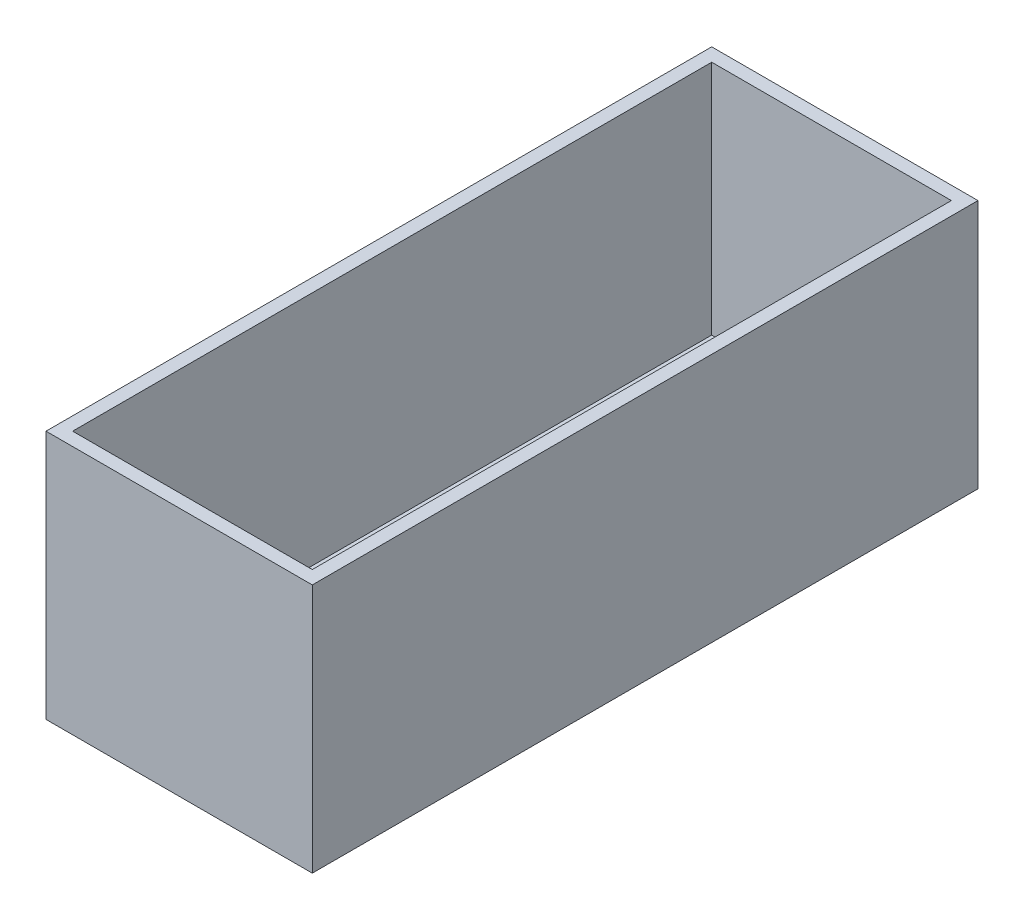
ISO-10303-21;
HEADER;
FILE_DESCRIPTION(('STEP AP214'),'2;1');
FILE_NAME('part.step','',(''),(''),'','','');
FILE_SCHEMA(('AUTOMOTIVE_DESIGN { 1 0 10303 214 1 1 1 1 }'));
ENDSEC;
DATA;
#1=APPLICATION_CONTEXT('core data for automotive mechanical design processes');
#2=APPLICATION_PROTOCOL_DEFINITION('international standard','automotive_design',2000,#1);
#3=PRODUCT_CONTEXT('',#1,'mechanical');
#4=PRODUCT('Part','Part','',(#3));
#5=PRODUCT_RELATED_PRODUCT_CATEGORY('part','',(#4));
#6=PRODUCT_DEFINITION_FORMATION('','',#4);
#7=PRODUCT_DEFINITION_CONTEXT('part definition',#1,'design');
#8=PRODUCT_DEFINITION('design','',#6,#7);
#9=PRODUCT_DEFINITION_SHAPE('','',#8);
#10=(LENGTH_UNIT() NAMED_UNIT(*) SI_UNIT(.MILLI.,.METRE.));
#11=(NAMED_UNIT(*) PLANE_ANGLE_UNIT() SI_UNIT($,.RADIAN.));
#12=(NAMED_UNIT(*) SI_UNIT($,.STERADIAN.) SOLID_ANGLE_UNIT());
#13=UNCERTAINTY_MEASURE_WITH_UNIT(LENGTH_MEASURE(1.E-05),#10,'distance_accuracy_value','');
#14=(GEOMETRIC_REPRESENTATION_CONTEXT(3) GLOBAL_UNCERTAINTY_ASSIGNED_CONTEXT((#13)) GLOBAL_UNIT_ASSIGNED_CONTEXT((#10,
#11,#12)) REPRESENTATION_CONTEXT('',''));
#15=CARTESIAN_POINT('',(0.,0.,0.));
#16=DIRECTION('',(0.,0.,1.));
#17=DIRECTION('',(1.,0.,0.));
#18=AXIS2_PLACEMENT_3D('',#15,#16,#17);
#19=CARTESIAN_POINT('',(0.,75.,-200.));
#20=DIRECTION('',(0.,1.,0.));
#21=DIRECTION('',(0.,0.,1.));
#22=AXIS2_PLACEMENT_3D('',#19,#20,#21);
#23=PLANE('',#22);
#24=DIRECTION('',(-1.,0.,0.));
#25=VECTOR('',#24,1.);
#26=CARTESIAN_POINT('',(0.,75.,0.));
#27=LINE('',#26,#25);
#28=CARTESIAN_POINT('',(80.,75.,0.));
#29=VERTEX_POINT('',#28);
#30=CARTESIAN_POINT('',(0.,75.,0.));
#31=VERTEX_POINT('',#30);
#32=EDGE_CURVE('E150',#29,#31,#27,.T.);
#33=ORIENTED_EDGE('',*,*,#32,.F.);
#34=DIRECTION('',(0.,0.,1.));
#35=VECTOR('',#34,1.);
#36=CARTESIAN_POINT('',(80.,75.,-200.));
#37=LINE('',#36,#35);
#38=CARTESIAN_POINT('',(80.,75.,-200.));
#39=VERTEX_POINT('',#38);
#40=EDGE_CURVE('E42',#39,#29,#37,.T.);
#41=ORIENTED_EDGE('',*,*,#40,.F.);
#42=DIRECTION('',(-1.,0.,0.));
#43=VECTOR('',#42,1.);
#44=CARTESIAN_POINT('',(0.,75.,-200.));
#45=LINE('',#44,#43);
#46=CARTESIAN_POINT('',(0.,75.,-200.));
#47=VERTEX_POINT('',#46);
#48=EDGE_CURVE('E155',#39,#47,#45,.T.);
#49=ORIENTED_EDGE('',*,*,#48,.T.);
#50=DIRECTION('',(0.,0.,1.));
#51=VECTOR('',#50,1.);
#52=CARTESIAN_POINT('',(0.,75.,-200.));
#53=LINE('',#52,#51);
#54=EDGE_CURVE('E11',#47,#31,#53,.T.);
#55=ORIENTED_EDGE('',*,*,#54,.T.);
#56=EDGE_LOOP('',(#33,#41,#49,#55));
#57=FACE_BOUND('',#56,.T.);
#58=DIRECTION('',(0.,0.,1.));
#59=VECTOR('',#58,1.);
#60=CARTESIAN_POINT('',(76.,75.,-200.));
#61=LINE('',#60,#59);
#62=CARTESIAN_POINT('',(76.,75.,-196.));
#63=VERTEX_POINT('',#62);
#64=CARTESIAN_POINT('',(76.,75.,-4.));
#65=VERTEX_POINT('',#64);
#66=EDGE_CURVE('E138',#63,#65,#61,.T.);
#67=ORIENTED_EDGE('',*,*,#66,.T.);
#68=DIRECTION('',(-1.,0.,0.));
#69=VECTOR('',#68,1.);
#70=CARTESIAN_POINT('',(0.,75.,-4.));
#71=LINE('',#70,#69);
#72=CARTESIAN_POINT('',(4.,75.,-4.));
#73=VERTEX_POINT('',#72);
#74=EDGE_CURVE('E133',#65,#73,#71,.T.);
#75=ORIENTED_EDGE('',*,*,#74,.T.);
#76=DIRECTION('',(0.,0.,1.));
#77=VECTOR('',#76,1.);
#78=CARTESIAN_POINT('',(4.,75.,-200.));
#79=LINE('',#78,#77);
#80=CARTESIAN_POINT('',(4.,75.,-196.));
#81=VERTEX_POINT('',#80);
#82=EDGE_CURVE('E129',#81,#73,#79,.T.);
#83=ORIENTED_EDGE('',*,*,#82,.F.);
#84=DIRECTION('',(-1.,0.,0.));
#85=VECTOR('',#84,1.);
#86=CARTESIAN_POINT('',(0.,75.,-196.));
#87=LINE('',#86,#85);
#88=EDGE_CURVE('E50',#63,#81,#87,.T.);
#89=ORIENTED_EDGE('',*,*,#88,.F.);
#90=EDGE_LOOP('',(#67,#75,#83,#89));
#91=FACE_BOUND('',#90,.T.);
#92=ADVANCED_FACE('F33',(#57,#91),#23,.T.);
#93=CARTESIAN_POINT('',(0.,0.,-200.));
#94=DIRECTION('',(-1.,0.,0.));
#95=DIRECTION('',(0.,0.,1.));
#96=AXIS2_PLACEMENT_3D('',#93,#94,#95);
#97=PLANE('',#96);
#98=DIRECTION('',(0.,-1.,0.));
#99=VECTOR('',#98,1.);
#100=CARTESIAN_POINT('',(0.,0.,0.));
#101=LINE('',#100,#99);
#102=CARTESIAN_POINT('',(0.,0.,0.));
#103=VERTEX_POINT('',#102);
#104=EDGE_CURVE('E142',#31,#103,#101,.T.);
#105=ORIENTED_EDGE('',*,*,#104,.F.);
#106=ORIENTED_EDGE('',*,*,#54,.F.);
#107=DIRECTION('',(0.,-1.,0.));
#108=VECTOR('',#107,1.);
#109=CARTESIAN_POINT('',(0.,0.,-200.));
#110=LINE('',#109,#108);
#111=CARTESIAN_POINT('',(0.,0.,-200.));
#112=VERTEX_POINT('',#111);
#113=EDGE_CURVE('E147',#47,#112,#110,.T.);
#114=ORIENTED_EDGE('',*,*,#113,.T.);
#115=DIRECTION('',(0.,0.,1.));
#116=VECTOR('',#115,1.);
#117=CARTESIAN_POINT('',(0.,0.,-200.));
#118=LINE('',#117,#116);
#119=EDGE_CURVE('E37',#112,#103,#118,.T.);
#120=ORIENTED_EDGE('',*,*,#119,.T.);
#121=EDGE_LOOP('',(#105,#106,#114,#120));
#122=FACE_BOUND('',#121,.T.);
#123=ADVANCED_FACE('F35',(#122),#97,.T.);
#124=CARTESIAN_POINT('',(80.,0.,-200.));
#125=DIRECTION('',(1.,0.,0.));
#126=DIRECTION('',(0.,0.,-1.));
#127=AXIS2_PLACEMENT_3D('',#124,#125,#126);
#128=PLANE('',#127);
#129=DIRECTION('',(0.,1.,0.));
#130=VECTOR('',#129,1.);
#131=CARTESIAN_POINT('',(80.,0.,0.));
#132=LINE('',#131,#130);
#133=CARTESIAN_POINT('',(80.,0.,0.));
#134=VERTEX_POINT('',#133);
#135=EDGE_CURVE('E162',#134,#29,#132,.T.);
#136=ORIENTED_EDGE('',*,*,#135,.F.);
#137=DIRECTION('',(0.,0.,1.));
#138=VECTOR('',#137,1.);
#139=CARTESIAN_POINT('',(80.,0.,-200.));
#140=LINE('',#139,#138);
#141=CARTESIAN_POINT('',(80.,0.,-200.));
#142=VERTEX_POINT('',#141);
#143=EDGE_CURVE('E167',#142,#134,#140,.T.);
#144=ORIENTED_EDGE('',*,*,#143,.F.);
#145=DIRECTION('',(0.,1.,0.));
#146=VECTOR('',#145,1.);
#147=CARTESIAN_POINT('',(80.,0.,-200.));
#148=LINE('',#147,#146);
#149=EDGE_CURVE('E152',#142,#39,#148,.T.);
#150=ORIENTED_EDGE('',*,*,#149,.T.);
#151=ORIENTED_EDGE('',*,*,#40,.T.);
#152=EDGE_LOOP('',(#136,#144,#150,#151));
#153=FACE_BOUND('',#152,.T.);
#154=ADVANCED_FACE('F176',(#153),#128,.T.);
#155=CARTESIAN_POINT('',(0.,0.,-200.));
#156=DIRECTION('',(0.,-1.,0.));
#157=DIRECTION('',(0.,0.,-1.));
#158=AXIS2_PLACEMENT_3D('',#155,#156,#157);
#159=PLANE('',#158);
#160=DIRECTION('',(1.,0.,0.));
#161=VECTOR('',#160,1.);
#162=CARTESIAN_POINT('',(0.,0.,0.));
#163=LINE('',#162,#161);
#164=EDGE_CURVE('E159',#103,#134,#163,.T.);
#165=ORIENTED_EDGE('',*,*,#164,.F.);
#166=ORIENTED_EDGE('',*,*,#119,.F.);
#167=DIRECTION('',(1.,0.,0.));
#168=VECTOR('',#167,1.);
#169=CARTESIAN_POINT('',(0.,0.,-200.));
#170=LINE('',#169,#168);
#171=EDGE_CURVE('E149',#112,#142,#170,.T.);
#172=ORIENTED_EDGE('',*,*,#171,.T.);
#173=ORIENTED_EDGE('',*,*,#143,.T.);
#174=EDGE_LOOP('',(#165,#166,#172,#173));
#175=FACE_BOUND('',#174,.T.);
#176=ADVANCED_FACE('F169',(#175),#159,.T.);
#177=CARTESIAN_POINT('',(0.,0.,-200.));
#178=DIRECTION('',(0.,0.,-1.));
#179=DIRECTION('',(-1.,0.,0.));
#180=AXIS2_PLACEMENT_3D('',#177,#178,#179);
#181=PLANE('',#180);
#182=ORIENTED_EDGE('',*,*,#113,.F.);
#183=ORIENTED_EDGE('',*,*,#48,.F.);
#184=ORIENTED_EDGE('',*,*,#149,.F.);
#185=ORIENTED_EDGE('',*,*,#171,.F.);
#186=EDGE_LOOP('',(#182,#183,#184,#185));
#187=FACE_BOUND('',#186,.T.);
#188=ADVANCED_FACE('F178',(#187),#181,.T.);
#189=CARTESIAN_POINT('',(0.,0.,0.));
#190=DIRECTION('',(0.,0.,-1.));
#191=DIRECTION('',(-1.,0.,0.));
#192=AXIS2_PLACEMENT_3D('',#189,#190,#191);
#193=PLANE('',#192);
#194=ORIENTED_EDGE('',*,*,#104,.T.);
#195=ORIENTED_EDGE('',*,*,#164,.T.);
#196=ORIENTED_EDGE('',*,*,#135,.T.);
#197=ORIENTED_EDGE('',*,*,#32,.T.);
#198=EDGE_LOOP('',(#194,#195,#196,#197));
#199=FACE_BOUND('',#198,.T.);
#200=ADVANCED_FACE('F171',(#199),#193,.F.);
#201=CARTESIAN_POINT('',(4.,0.,-200.));
#202=DIRECTION('',(-1.,0.,0.));
#203=DIRECTION('',(0.,0.,1.));
#204=AXIS2_PLACEMENT_3D('',#201,#202,#203);
#205=PLANE('',#204);
#206=DIRECTION('',(0.,-1.,0.));
#207=VECTOR('',#206,1.);
#208=CARTESIAN_POINT('',(4.,0.,-4.));
#209=LINE('',#208,#207);
#210=CARTESIAN_POINT('',(4.,4.,-4.));
#211=VERTEX_POINT('',#210);
#212=EDGE_CURVE('E123',#73,#211,#209,.T.);
#213=ORIENTED_EDGE('',*,*,#212,.T.);
#214=DIRECTION('',(0.,0.,1.));
#215=VECTOR('',#214,1.);
#216=CARTESIAN_POINT('',(4.,4.,-200.));
#217=LINE('',#216,#215);
#218=CARTESIAN_POINT('',(4.,4.,-196.));
#219=VERTEX_POINT('',#218);
#220=EDGE_CURVE('E108',#219,#211,#217,.T.);
#221=ORIENTED_EDGE('',*,*,#220,.F.);
#222=DIRECTION('',(0.,-1.,0.));
#223=VECTOR('',#222,1.);
#224=CARTESIAN_POINT('',(4.,0.,-196.));
#225=LINE('',#224,#223);
#226=EDGE_CURVE('E132',#81,#219,#225,.T.);
#227=ORIENTED_EDGE('',*,*,#226,.F.);
#228=ORIENTED_EDGE('',*,*,#82,.T.);
#229=EDGE_LOOP('',(#213,#221,#227,#228));
#230=FACE_BOUND('',#229,.T.);
#231=ADVANCED_FACE('F127',(#230),#205,.F.);
#232=CARTESIAN_POINT('',(76.,0.,-200.));
#233=DIRECTION('',(1.,0.,0.));
#234=DIRECTION('',(0.,0.,-1.));
#235=AXIS2_PLACEMENT_3D('',#232,#233,#234);
#236=PLANE('',#235);
#237=DIRECTION('',(0.,1.,0.));
#238=VECTOR('',#237,1.);
#239=CARTESIAN_POINT('',(76.,0.,-4.));
#240=LINE('',#239,#238);
#241=CARTESIAN_POINT('',(76.,4.,-4.));
#242=VERTEX_POINT('',#241);
#243=EDGE_CURVE('E125',#242,#65,#240,.T.);
#244=ORIENTED_EDGE('',*,*,#243,.T.);
#245=ORIENTED_EDGE('',*,*,#66,.F.);
#246=DIRECTION('',(0.,1.,0.));
#247=VECTOR('',#246,1.);
#248=CARTESIAN_POINT('',(76.,0.,-196.));
#249=LINE('',#248,#247);
#250=CARTESIAN_POINT('',(76.,4.,-196.));
#251=VERTEX_POINT('',#250);
#252=EDGE_CURVE('E136',#251,#63,#249,.T.);
#253=ORIENTED_EDGE('',*,*,#252,.F.);
#254=DIRECTION('',(0.,0.,1.));
#255=VECTOR('',#254,1.);
#256=CARTESIAN_POINT('',(76.,4.,-200.));
#257=LINE('',#256,#255);
#258=EDGE_CURVE('E116',#251,#242,#257,.T.);
#259=ORIENTED_EDGE('',*,*,#258,.T.);
#260=EDGE_LOOP('',(#244,#245,#253,#259));
#261=FACE_BOUND('',#260,.T.);
#262=ADVANCED_FACE('F225',(#261),#236,.F.);
#263=CARTESIAN_POINT('',(0.,4.,-200.));
#264=DIRECTION('',(0.,-1.,0.));
#265=DIRECTION('',(0.,0.,-1.));
#266=AXIS2_PLACEMENT_3D('',#263,#264,#265);
#267=PLANE('',#266);
#268=DIRECTION('',(1.,0.,0.));
#269=VECTOR('',#268,1.);
#270=CARTESIAN_POINT('',(0.,4.,-4.));
#271=LINE('',#270,#269);
#272=EDGE_CURVE('E111',#211,#242,#271,.T.);
#273=ORIENTED_EDGE('',*,*,#272,.T.);
#274=ORIENTED_EDGE('',*,*,#258,.F.);
#275=DIRECTION('',(1.,0.,0.));
#276=VECTOR('',#275,1.);
#277=CARTESIAN_POINT('',(0.,4.,-196.));
#278=LINE('',#277,#276);
#279=EDGE_CURVE('E113',#219,#251,#278,.T.);
#280=ORIENTED_EDGE('',*,*,#279,.F.);
#281=ORIENTED_EDGE('',*,*,#220,.T.);
#282=EDGE_LOOP('',(#273,#274,#280,#281));
#283=FACE_BOUND('',#282,.T.);
#284=ADVANCED_FACE('F110',(#283),#267,.F.);
#285=CARTESIAN_POINT('',(0.,0.,-196.));
#286=DIRECTION('',(0.,0.,-1.));
#287=DIRECTION('',(-1.,0.,0.));
#288=AXIS2_PLACEMENT_3D('',#285,#286,#287);
#289=PLANE('',#288);
#290=ORIENTED_EDGE('',*,*,#226,.T.);
#291=ORIENTED_EDGE('',*,*,#279,.T.);
#292=ORIENTED_EDGE('',*,*,#252,.T.);
#293=ORIENTED_EDGE('',*,*,#88,.T.);
#294=EDGE_LOOP('',(#290,#291,#292,#293));
#295=FACE_BOUND('',#294,.T.);
#296=ADVANCED_FACE('F243',(#295),#289,.F.);
#297=CARTESIAN_POINT('',(0.,0.,-4.));
#298=DIRECTION('',(0.,0.,-1.));
#299=DIRECTION('',(-1.,0.,0.));
#300=AXIS2_PLACEMENT_3D('',#297,#298,#299);
#301=PLANE('',#300);
#302=ORIENTED_EDGE('',*,*,#212,.F.);
#303=ORIENTED_EDGE('',*,*,#74,.F.);
#304=ORIENTED_EDGE('',*,*,#243,.F.);
#305=ORIENTED_EDGE('',*,*,#272,.F.);
#306=EDGE_LOOP('',(#302,#303,#304,#305));
#307=FACE_BOUND('',#306,.T.);
#308=ADVANCED_FACE('F121',(#307),#301,.T.);
#309=CLOSED_SHELL('',(#92,#123,#154,#176,#188,#200,#231,#262,#284,#296,#308));
#310=MANIFOLD_SOLID_BREP('B2',#309);
#311=ADVANCED_BREP_SHAPE_REPRESENTATION('',(#18,#310),#14);
#312=SHAPE_DEFINITION_REPRESENTATION(#9,#311);
ENDSEC;
END-ISO-10303-21;
